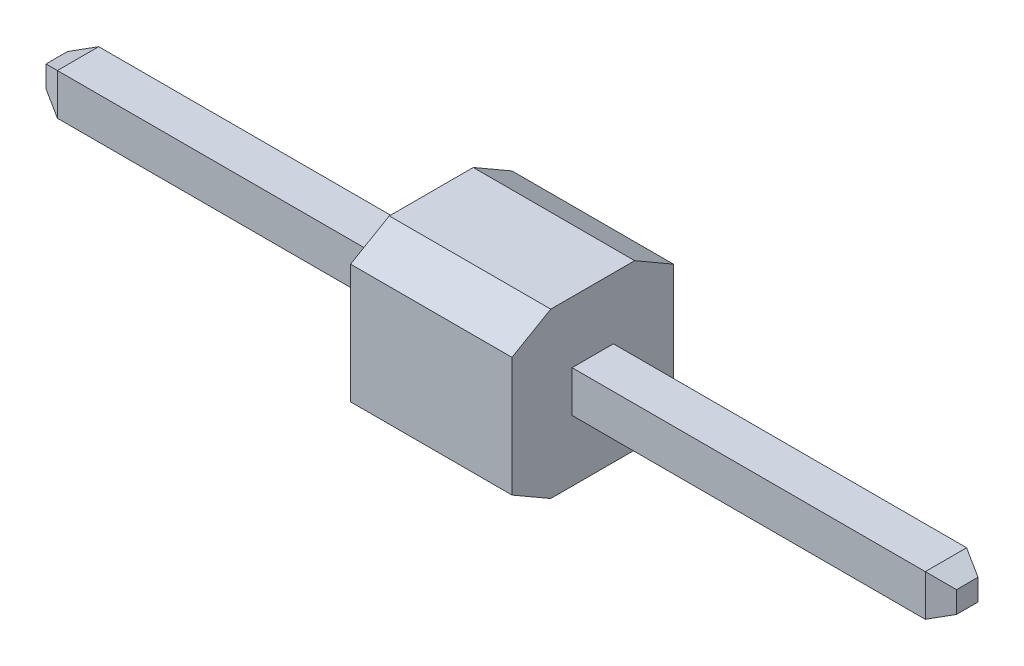
ISO-10303-21;
HEADER;
FILE_DESCRIPTION(('STEP AP214'),'2;1');
FILE_NAME('part.step','',(''),(''),'','','');
FILE_SCHEMA(('AUTOMOTIVE_DESIGN { 1 0 10303 214 1 1 1 1 }'));
ENDSEC;
DATA;
#1=APPLICATION_CONTEXT('core data for automotive mechanical design processes');
#2=APPLICATION_PROTOCOL_DEFINITION('international standard','automotive_design',2000,#1);
#3=PRODUCT_CONTEXT('',#1,'mechanical');
#4=PRODUCT('Part','Part','',(#3));
#5=PRODUCT_RELATED_PRODUCT_CATEGORY('part','',(#4));
#6=PRODUCT_DEFINITION_FORMATION('','',#4);
#7=PRODUCT_DEFINITION_CONTEXT('part definition',#1,'design');
#8=PRODUCT_DEFINITION('design','',#6,#7);
#9=PRODUCT_DEFINITION_SHAPE('','',#8);
#10=(LENGTH_UNIT() NAMED_UNIT(*) SI_UNIT(.MILLI.,.METRE.));
#11=(NAMED_UNIT(*) PLANE_ANGLE_UNIT() SI_UNIT($,.RADIAN.));
#12=(NAMED_UNIT(*) SI_UNIT($,.STERADIAN.) SOLID_ANGLE_UNIT());
#13=UNCERTAINTY_MEASURE_WITH_UNIT(LENGTH_MEASURE(1.E-05),#10,'distance_accuracy_value','');
#14=(GEOMETRIC_REPRESENTATION_CONTEXT(3) GLOBAL_UNCERTAINTY_ASSIGNED_CONTEXT((#13)) GLOBAL_UNIT_ASSIGNED_CONTEXT((#10,
#11,#12)) REPRESENTATION_CONTEXT('',''));
#15=CARTESIAN_POINT('',(0.,0.,0.));
#16=DIRECTION('',(0.,0.,1.));
#17=DIRECTION('',(1.,0.,0.));
#18=AXIS2_PLACEMENT_3D('',#15,#16,#17);
#19=CARTESIAN_POINT('',(5.42107489509749,-7.30288427394286,-2.77111992940321));
#20=DIRECTION('',(1.,-9.93476518829084E-08,4.37113882867379E-08));
#21=DIRECTION('',(-9.93476589883358E-08,-1.,8.74227765734759E-08));
#22=AXIS2_PLACEMENT_3D('',#19,#20,#21);
#23=PLANE('',#22);
#24=DIRECTION('',(-1.18186619959243E-08,-0.500000075710538,-0.866025360072935));
#25=VECTOR('',#24,1.);
#26=CARTESIAN_POINT('',(5.42107470292288,-8.54647397517509,-1.20111982068513));
#27=LINE('',#26,#25);
#28=CARTESIAN_POINT('',(5.42107470292288,-8.54647397517509,-1.20111982068513));
#29=VERTEX_POINT('',#28);
#30=CARTESIAN_POINT('',(5.42107469473467,-8.89288418914276,-1.80111979040099));
#31=VERTEX_POINT('',#30);
#32=EDGE_CURVE('E11',#29,#31,#27,.T.);
#33=ORIENTED_EDGE('',*,*,#32,.T.);
#34=DIRECTION('',(4.37113811813104E-08,-8.74227842254741E-08,-0.999999999999995));
#35=VECTOR('',#34,1.);
#36=CARTESIAN_POINT('',(5.42107469473467,-8.89288418914276,-1.80111979040099));
#37=LINE('',#36,#35);
#38=CARTESIAN_POINT('',(5.42107475155946,-8.89288430279238,-3.10111979040099));
#39=VERTEX_POINT('',#38);
#40=EDGE_CURVE('E304',#31,#39,#37,.T.);
#41=ORIENTED_EDGE('',*,*,#40,.T.);
#42=DIRECTION('',(8.75289950709516E-08,0.499999924289837,-0.866025447495713));
#43=VECTOR('',#42,1.);
#44=CARTESIAN_POINT('',(5.42107475155946,-8.89288430279238,-3.10111979040099));
#45=LINE('',#44,#43);
#46=CARTESIAN_POINT('',(5.42107481220133,-8.54647419373205,-3.70111982068513));
#47=VERTEX_POINT('',#46);
#48=EDGE_CURVE('E296',#39,#47,#45,.T.);
#49=ORIENTED_EDGE('',*,*,#48,.T.);
#50=DIRECTION('',(9.93476593243697E-08,0.999999999999991,-8.74227764821842E-08));
#51=VECTOR('',#50,1.);
#52=CARTESIAN_POINT('',(5.42107481220133,-8.54647419373205,-3.70111982068513));
#53=LINE('',#52,#51);
#54=CARTESIAN_POINT('',(5.42107499571431,-6.69929451676005,-3.70111998217071));
#55=VERTEX_POINT('',#54);
#56=EDGE_CURVE('E281',#47,#55,#53,.T.);
#57=ORIENTED_EDGE('',*,*,#56,.T.);
#58=DIRECTION('',(-1.18186632778994E-08,-0.500000075710539,-0.866025360072934));
#59=VECTOR('',#58,1.);
#60=CARTESIAN_POINT('',(5.42107500390252,-6.35288430279238,-3.10112001245485));
#61=LINE('',#60,#59);
#62=CARTESIAN_POINT('',(5.42107500390252,-6.35288430279238,-3.10112001245485));
#63=VERTEX_POINT('',#62);
#64=EDGE_CURVE('E265',#63,#55,#61,.T.);
#65=ORIENTED_EDGE('',*,*,#64,.F.);
#66=DIRECTION('',(4.37113811813104E-08,-8.74227835422599E-08,-0.999999999999995));
#67=VECTOR('',#66,1.);
#68=CARTESIAN_POINT('',(5.42107494707772,-6.35288418914276,-1.80112001245485));
#69=LINE('',#68,#67);
#70=CARTESIAN_POINT('',(5.42107494707772,-6.35288418914276,-1.80112001245485));
#71=VERTEX_POINT('',#70);
#72=EDGE_CURVE('E248',#71,#63,#69,.T.);
#73=ORIENTED_EDGE('',*,*,#72,.F.);
#74=DIRECTION('',(8.75289963529268E-08,0.499999924289837,-0.866025447495713));
#75=VECTOR('',#74,1.);
#76=CARTESIAN_POINT('',(5.42107488643585,-6.69929429820309,-1.20111998217071));
#77=LINE('',#76,#75);
#78=CARTESIAN_POINT('',(5.42107488643585,-6.69929429820309,-1.20111998217071));
#79=VERTEX_POINT('',#78);
#80=EDGE_CURVE('E242',#79,#71,#77,.T.);
#81=ORIENTED_EDGE('',*,*,#80,.F.);
#82=DIRECTION('',(9.93476593243697E-08,0.999999999999991,-8.74227763619768E-08));
#83=VECTOR('',#82,1.);
#84=CARTESIAN_POINT('',(5.42107470292288,-8.54647397517509,-1.20111982068513));
#85=LINE('',#84,#83);
#86=EDGE_CURVE('E236',#29,#79,#85,.T.);
#87=ORIENTED_EDGE('',*,*,#86,.F.);
#88=EDGE_LOOP('',(#33,#41,#49,#57,#65,#73,#81,#87));
#89=FACE_BOUND('',#88,.T.);
#90=DIRECTION('',(-4.37113817364219E-08,8.74227842895255E-08,0.999999999999995));
#91=VECTOR('',#90,1.);
#92=CARTESIAN_POINT('',(5.42107483151498,-7.94288427394286,-2.77111987345263));
#93=LINE('',#92,#91);
#94=CARTESIAN_POINT('',(5.42107483151498,-7.94288427394286,-2.77111987345263));
#95=VERTEX_POINT('',#94);
#96=CARTESIAN_POINT('',(5.4210748035397,-7.94288421799228,-2.13111987345263));
#97=VERTEX_POINT('',#96);
#98=EDGE_CURVE('E302',#95,#97,#93,.T.);
#99=ORIENTED_EDGE('',*,*,#98,.T.);
#100=DIRECTION('',(-9.93476592658907E-08,-0.999999999999991,8.74227759628525E-08));
#101=VECTOR('',#100,1.);
#102=CARTESIAN_POINT('',(5.4210748671222,-7.30288421799228,-2.13111992940321));
#103=LINE('',#102,#101);
#104=CARTESIAN_POINT('',(5.4210748671222,-7.30288421799228,-2.13111992940321));
#105=VERTEX_POINT('',#104);
#106=EDGE_CURVE('E293',#105,#97,#103,.T.);
#107=ORIENTED_EDGE('',*,*,#106,.F.);
#108=DIRECTION('',(-4.37113817364219E-08,8.74227842895254E-08,0.999999999999995));
#109=VECTOR('',#108,1.);
#110=CARTESIAN_POINT('',(5.42107489509749,-7.30288427394286,-2.77111992940321));
#111=LINE('',#110,#109);
#112=CARTESIAN_POINT('',(5.42107489509749,-7.30288427394286,-2.77111992940321));
#113=VERTEX_POINT('',#112);
#114=EDGE_CURVE('E278',#113,#105,#111,.T.);
#115=ORIENTED_EDGE('',*,*,#114,.F.);
#116=DIRECTION('',(-9.93476592658907E-08,-0.999999999999991,8.74227766567419E-08));
#117=VECTOR('',#116,1.);
#118=CARTESIAN_POINT('',(5.42107489509749,-7.30288427394286,-2.77111992940321));
#119=LINE('',#118,#117);
#120=EDGE_CURVE('E263',#113,#95,#119,.T.);
#121=ORIENTED_EDGE('',*,*,#120,.T.);
#122=EDGE_LOOP('',(#99,#107,#115,#121));
#123=FACE_BOUND('',#122,.T.);
#124=ADVANCED_FACE('F17',(#89,#123),#23,.T.);
#125=CARTESIAN_POINT('',(2.92107489509748,-7.30288402557373,-2.77112003868168));
#126=DIRECTION('',(1.,-9.93476518829084E-08,4.37113882867379E-08));
#127=DIRECTION('',(-9.93476589883358E-08,-1.,8.74227765734759E-08));
#128=AXIS2_PLACEMENT_3D('',#125,#126,#127);
#129=PLANE('',#128);
#130=DIRECTION('',(-1.18186626369119E-08,-0.500000075710538,-0.866025360072935));
#131=VECTOR('',#130,1.);
#132=CARTESIAN_POINT('',(2.92107470292288,-8.54647372680596,-1.2011199299636));
#133=LINE('',#132,#131);
#134=CARTESIAN_POINT('',(2.92107470292288,-8.54647372680596,-1.2011199299636));
#135=VERTEX_POINT('',#134);
#136=CARTESIAN_POINT('',(2.92107469473467,-8.89288394077363,-1.80111989967946));
#137=VERTEX_POINT('',#136);
#138=EDGE_CURVE('E24',#135,#137,#133,.T.);
#139=ORIENTED_EDGE('',*,*,#138,.F.);
#140=DIRECTION('',(9.9347659083955E-08,0.999999999999991,-8.74227763619768E-08));
#141=VECTOR('',#140,1.);
#142=CARTESIAN_POINT('',(2.92107470292288,-8.54647372680596,-1.2011199299636));
#143=LINE('',#142,#141);
#144=CARTESIAN_POINT('',(2.92107488643585,-6.69929404983396,-1.20112009144918));
#145=VERTEX_POINT('',#144);
#146=EDGE_CURVE('E300',#135,#145,#143,.T.);
#147=ORIENTED_EDGE('',*,*,#146,.T.);
#148=DIRECTION('',(8.75289963529268E-08,0.499999924289837,-0.866025447495713));
#149=VECTOR('',#148,1.);
#150=CARTESIAN_POINT('',(2.92107488643585,-6.69929404983396,-1.20112009144918));
#151=LINE('',#150,#149);
#152=CARTESIAN_POINT('',(2.92107494707772,-6.35288394077363,-1.80112012173332));
#153=VERTEX_POINT('',#152);
#154=EDGE_CURVE('E286',#145,#153,#151,.T.);
#155=ORIENTED_EDGE('',*,*,#154,.T.);
#156=DIRECTION('',(4.37113811813104E-08,-8.74227835422599E-08,-0.999999999999995));
#157=VECTOR('',#156,1.);
#158=CARTESIAN_POINT('',(2.92107494707772,-6.35288394077363,-1.80112012173332));
#159=LINE('',#158,#157);
#160=CARTESIAN_POINT('',(2.92107500390252,-6.35288405442325,-3.10112012173332));
#161=VERTEX_POINT('',#160);
#162=EDGE_CURVE('E271',#153,#161,#159,.T.);
#163=ORIENTED_EDGE('',*,*,#162,.T.);
#164=DIRECTION('',(-1.18186632778994E-08,-0.500000075710539,-0.866025360072934));
#165=VECTOR('',#164,1.);
#166=CARTESIAN_POINT('',(2.92107500390252,-6.35288405442325,-3.10112012173332));
#167=LINE('',#166,#165);
#168=CARTESIAN_POINT('',(2.92107499571431,-6.69929426839092,-3.70112009144918));
#169=VERTEX_POINT('',#168);
#170=EDGE_CURVE('E253',#161,#169,#167,.T.);
#171=ORIENTED_EDGE('',*,*,#170,.T.);
#172=DIRECTION('',(9.9347659083955E-08,0.999999999999991,-8.74227764821842E-08));
#173=VECTOR('',#172,1.);
#174=CARTESIAN_POINT('',(2.92107481220133,-8.54647394536292,-3.7011199299636));
#175=LINE('',#174,#173);
#176=CARTESIAN_POINT('',(2.92107481220133,-8.54647394536292,-3.7011199299636));
#177=VERTEX_POINT('',#176);
#178=EDGE_CURVE('E261',#177,#169,#175,.T.);
#179=ORIENTED_EDGE('',*,*,#178,.F.);
#180=DIRECTION('',(8.75289957119392E-08,0.499999924289837,-0.866025447495713));
#181=VECTOR('',#180,1.);
#182=CARTESIAN_POINT('',(2.92107475155946,-8.89288405442325,-3.10111989967946));
#183=LINE('',#182,#181);
#184=CARTESIAN_POINT('',(2.92107475155946,-8.89288405442325,-3.10111989967946));
#185=VERTEX_POINT('',#184);
#186=EDGE_CURVE('E276',#185,#177,#183,.T.);
#187=ORIENTED_EDGE('',*,*,#186,.F.);
#188=DIRECTION('',(4.37113811813104E-08,-8.74227842254741E-08,-0.999999999999995));
#189=VECTOR('',#188,1.);
#190=CARTESIAN_POINT('',(2.92107469473467,-8.89288394077363,-1.80111989967946));
#191=LINE('',#190,#189);
#192=EDGE_CURVE('E291',#137,#185,#191,.T.);
#193=ORIENTED_EDGE('',*,*,#192,.F.);
#194=EDGE_LOOP('',(#139,#147,#155,#163,#171,#179,#187,#193));
#195=FACE_BOUND('',#194,.T.);
#196=DIRECTION('',(-9.93476592658907E-08,-0.999999999999991,8.74227759628525E-08));
#197=VECTOR('',#196,1.);
#198=CARTESIAN_POINT('',(2.9210748671222,-7.30288396962315,-2.13112003868168));
#199=LINE('',#198,#197);
#200=CARTESIAN_POINT('',(2.9210748671222,-7.30288396962315,-2.13112003868168));
#201=VERTEX_POINT('',#200);
#202=CARTESIAN_POINT('',(2.9210748035397,-7.94288396962315,-2.1311199827311));
#203=VERTEX_POINT('',#202);
#204=EDGE_CURVE('E298',#201,#203,#199,.T.);
#205=ORIENTED_EDGE('',*,*,#204,.T.);
#206=DIRECTION('',(-4.37113817364219E-08,8.74227842895255E-08,0.999999999999995));
#207=VECTOR('',#206,1.);
#208=CARTESIAN_POINT('',(2.92107483151498,-7.94288402557373,-2.7711199827311));
#209=LINE('',#208,#207);
#210=CARTESIAN_POINT('',(2.92107483151498,-7.94288402557373,-2.7711199827311));
#211=VERTEX_POINT('',#210);
#212=EDGE_CURVE('E283',#211,#203,#209,.T.);
#213=ORIENTED_EDGE('',*,*,#212,.F.);
#214=DIRECTION('',(-9.93476585720013E-08,-0.999999999999991,8.74227766567419E-08));
#215=VECTOR('',#214,1.);
#216=CARTESIAN_POINT('',(2.92107489509748,-7.30288402557373,-2.77112003868168));
#217=LINE('',#216,#215);
#218=CARTESIAN_POINT('',(2.92107489509748,-7.30288402557373,-2.77112003868168));
#219=VERTEX_POINT('',#218);
#220=EDGE_CURVE('E268',#219,#211,#217,.T.);
#221=ORIENTED_EDGE('',*,*,#220,.F.);
#222=DIRECTION('',(-4.37113810425325E-08,8.74227842895254E-08,0.999999999999995));
#223=VECTOR('',#222,1.);
#224=CARTESIAN_POINT('',(2.92107489509748,-7.30288402557373,-2.77112003868168));
#225=LINE('',#224,#223);
#226=EDGE_CURVE('E251',#219,#201,#225,.T.);
#227=ORIENTED_EDGE('',*,*,#226,.T.);
#228=EDGE_LOOP('',(#205,#213,#221,#227));
#229=FACE_BOUND('',#228,.T.);
#230=ADVANCED_FACE('F314',(#195,#229),#129,.F.);
#231=CARTESIAN_POINT('',(5.42107470292288,-8.54647397517509,-1.20111982068513));
#232=DIRECTION('',(1.07893287081065E-07,0.866025360072937,-0.500000075710535));
#233=DIRECTION('',(1.18186629566715E-08,0.500000075710542,0.866025360072941));
#234=AXIS2_PLACEMENT_3D('',#231,#232,#233);
#235=PLANE('',#234);
#236=ORIENTED_EDGE('',*,*,#138,.T.);
#237=DIRECTION('',(-0.999999999999994,9.93476518829078E-08,-4.37113883755555E-08));
#238=VECTOR('',#237,1.);
#239=CARTESIAN_POINT('',(5.42107469473467,-8.89288418914276,-1.80111979040099));
#240=LINE('',#239,#238);
#241=EDGE_CURVE('E288',#31,#137,#240,.T.);
#242=ORIENTED_EDGE('',*,*,#241,.F.);
#243=ORIENTED_EDGE('',*,*,#32,.F.);
#244=DIRECTION('',(-0.999999999999994,9.93476518829078E-08,-4.3711388109102E-08));
#245=VECTOR('',#244,1.);
#246=CARTESIAN_POINT('',(5.42107470292288,-8.54647397517509,-1.20111982068513));
#247=LINE('',#246,#245);
#248=EDGE_CURVE('E256',#29,#135,#247,.T.);
#249=ORIENTED_EDGE('',*,*,#248,.T.);
#250=EDGE_LOOP('',(#236,#242,#243,#249));
#251=FACE_BOUND('',#250,.T.);
#252=ADVANCED_FACE('F306',(#251),#235,.F.);
#253=CARTESIAN_POINT('',(5.42107469473467,-8.89288418914276,-1.80111979040099));
#254=DIRECTION('',(9.93476589883358E-08,1.,-8.74227765734759E-08));
#255=DIRECTION('',(1.,-9.93476518829084E-08,4.37113882867379E-08));
#256=AXIS2_PLACEMENT_3D('',#253,#254,#255);
#257=PLANE('',#256);
#258=ORIENTED_EDGE('',*,*,#192,.T.);
#259=DIRECTION('',(-0.999999999999994,9.93476518829078E-08,-4.37113882867377E-08));
#260=VECTOR('',#259,1.);
#261=CARTESIAN_POINT('',(5.42107475155946,-8.89288430279238,-3.10111979040099));
#262=LINE('',#261,#260);
#263=EDGE_CURVE('E273',#39,#185,#262,.T.);
#264=ORIENTED_EDGE('',*,*,#263,.F.);
#265=ORIENTED_EDGE('',*,*,#40,.F.);
#266=ORIENTED_EDGE('',*,*,#241,.T.);
#267=EDGE_LOOP('',(#258,#264,#265,#266));
#268=FACE_BOUND('',#267,.T.);
#269=ADVANCED_FACE('F311',(#268),#257,.F.);
#270=CARTESIAN_POINT('',(5.42107475155946,-8.89288430279238,-3.10111979040099));
#271=DIRECTION('',(6.41819058997377E-08,0.866025447495721,0.499999924289845));
#272=DIRECTION('',(-8.7528996031702E-08,-0.499999924289838,0.866025447495717));
#273=AXIS2_PLACEMENT_3D('',#270,#271,#272);
#274=PLANE('',#273);
#275=ORIENTED_EDGE('',*,*,#186,.T.);
#276=DIRECTION('',(-0.999999999999994,9.93476518829078E-08,-4.37113882867377E-08));
#277=VECTOR('',#276,1.);
#278=CARTESIAN_POINT('',(5.42107481220133,-8.54647419373205,-3.70111982068513));
#279=LINE('',#278,#277);
#280=EDGE_CURVE('E258',#47,#177,#279,.T.);
#281=ORIENTED_EDGE('',*,*,#280,.F.);
#282=ORIENTED_EDGE('',*,*,#48,.F.);
#283=ORIENTED_EDGE('',*,*,#263,.T.);
#284=EDGE_LOOP('',(#275,#281,#282,#283));
#285=FACE_BOUND('',#284,.T.);
#286=ADVANCED_FACE('F319',(#285),#274,.F.);
#287=CARTESIAN_POINT('',(5.42107481220133,-8.54647419373205,-3.70111982068513));
#288=DIRECTION('',(-4.37113811813106E-08,8.74227836789032E-08,1.));
#289=DIRECTION('',(-1.,9.93476518829084E-08,-4.37113882867379E-08));
#290=AXIS2_PLACEMENT_3D('',#287,#288,#289);
#291=PLANE('',#290);
#292=ORIENTED_EDGE('',*,*,#178,.T.);
#293=DIRECTION('',(-0.999999999999994,9.93476518829078E-08,-4.37113882867377E-08));
#294=VECTOR('',#293,1.);
#295=CARTESIAN_POINT('',(5.42107499571431,-6.69929451676005,-3.70111998217071));
#296=LINE('',#295,#294);
#297=EDGE_CURVE('E245',#55,#169,#296,.T.);
#298=ORIENTED_EDGE('',*,*,#297,.F.);
#299=ORIENTED_EDGE('',*,*,#56,.F.);
#300=ORIENTED_EDGE('',*,*,#280,.T.);
#301=EDGE_LOOP('',(#292,#298,#299,#300));
#302=FACE_BOUND('',#301,.T.);
#303=ADVANCED_FACE('F326',(#302),#291,.F.);
#304=CARTESIAN_POINT('',(5.42107500390252,-6.35288430279238,-3.10112001245485));
#305=DIRECTION('',(1.07893287081065E-07,0.866025360072937,-0.500000075710535));
#306=DIRECTION('',(1.18186629566715E-08,0.500000075710542,0.866025360072941));
#307=AXIS2_PLACEMENT_3D('',#304,#305,#306);
#308=PLANE('',#307);
#309=ORIENTED_EDGE('',*,*,#170,.F.);
#310=DIRECTION('',(-0.999999999999994,9.93476522381792E-08,-4.37113882867377E-08));
#311=VECTOR('',#310,1.);
#312=CARTESIAN_POINT('',(5.42107500390252,-6.35288430279238,-3.10112001245485));
#313=LINE('',#312,#311);
#314=EDGE_CURVE('E239',#63,#161,#313,.T.);
#315=ORIENTED_EDGE('',*,*,#314,.F.);
#316=ORIENTED_EDGE('',*,*,#64,.T.);
#317=ORIENTED_EDGE('',*,*,#297,.T.);
#318=EDGE_LOOP('',(#309,#315,#316,#317));
#319=FACE_BOUND('',#318,.T.);
#320=ADVANCED_FACE('F329',(#319),#308,.T.);
#321=CARTESIAN_POINT('',(5.42107494707772,-6.35288418914276,-1.80112001245485));
#322=DIRECTION('',(9.93476589883358E-08,1.,-8.74227765734759E-08));
#323=DIRECTION('',(1.,-9.93476518829084E-08,4.37113882867379E-08));
#324=AXIS2_PLACEMENT_3D('',#321,#322,#323);
#325=PLANE('',#324);
#326=ORIENTED_EDGE('',*,*,#162,.F.);
#327=DIRECTION('',(-0.999999999999994,9.93476522381792E-08,-4.37113884643734E-08));
#328=VECTOR('',#327,1.);
#329=CARTESIAN_POINT('',(5.42107494707772,-6.35288418914276,-1.80112001245485));
#330=LINE('',#329,#328);
#331=EDGE_CURVE('E233',#71,#153,#330,.T.);
#332=ORIENTED_EDGE('',*,*,#331,.F.);
#333=ORIENTED_EDGE('',*,*,#72,.T.);
#334=ORIENTED_EDGE('',*,*,#314,.T.);
#335=EDGE_LOOP('',(#326,#332,#333,#334));
#336=FACE_BOUND('',#335,.T.);
#337=ADVANCED_FACE('F333',(#336),#325,.T.);
#338=CARTESIAN_POINT('',(5.42107488643585,-6.69929429820309,-1.20111998217071));
#339=DIRECTION('',(6.41819058997377E-08,0.866025447495721,0.499999924289845));
#340=DIRECTION('',(-8.7528996031702E-08,-0.499999924289838,0.866025447495717));
#341=AXIS2_PLACEMENT_3D('',#338,#339,#340);
#342=PLANE('',#341);
#343=ORIENTED_EDGE('',*,*,#154,.F.);
#344=DIRECTION('',(-0.999999999999994,9.93476518829078E-08,-4.3711388109102E-08));
#345=VECTOR('',#344,1.);
#346=CARTESIAN_POINT('',(5.42107488643585,-6.69929429820309,-1.20111998217071));
#347=LINE('',#346,#345);
#348=EDGE_CURVE('E230',#79,#145,#347,.T.);
#349=ORIENTED_EDGE('',*,*,#348,.F.);
#350=ORIENTED_EDGE('',*,*,#80,.T.);
#351=ORIENTED_EDGE('',*,*,#331,.T.);
#352=EDGE_LOOP('',(#343,#349,#350,#351));
#353=FACE_BOUND('',#352,.T.);
#354=ADVANCED_FACE('F337',(#353),#342,.T.);
#355=CARTESIAN_POINT('',(5.42107470292288,-8.54647397517509,-1.20111982068513));
#356=DIRECTION('',(-4.37113811813106E-08,8.74227835615132E-08,1.));
#357=DIRECTION('',(-9.93476589883358E-08,-1.,8.74227764560859E-08));
#358=AXIS2_PLACEMENT_3D('',#355,#356,#357);
#359=PLANE('',#358);
#360=ORIENTED_EDGE('',*,*,#146,.F.);
#361=ORIENTED_EDGE('',*,*,#248,.F.);
#362=ORIENTED_EDGE('',*,*,#86,.T.);
#363=ORIENTED_EDGE('',*,*,#348,.T.);
#364=EDGE_LOOP('',(#360,#361,#362,#363));
#365=FACE_BOUND('',#364,.T.);
#366=ADVANCED_FACE('F339',(#365),#359,.T.);
#367=CARTESIAN_POINT('',(-2.87892510490252,-7.30288344935735,-2.77112029220773));
#368=DIRECTION('',(-1.,9.93476518829084E-08,-4.37113882867379E-08));
#369=DIRECTION('',(9.93476589883358E-08,1.,-8.74227765734759E-08));
#370=AXIS2_PLACEMENT_3D('',#367,#368,#369);
#371=PLANE('',#370);
#372=DIRECTION('',(9.93476581453995E-08,0.999999999999991,-8.74227774760709E-08));
#373=VECTOR('',#372,1.);
#374=CARTESIAN_POINT('',(-2.87892517444616,-7.78900187966852,-2.2850017769009));
#375=LINE('',#374,#373);
#376=CARTESIAN_POINT('',(-2.87892517444616,-7.78900187966852,-2.2850017769009));
#377=VERTEX_POINT('',#376);
#378=CARTESIAN_POINT('',(-2.87892514143919,-7.45676493405052,-2.28500180594598));
#379=VERTEX_POINT('',#378);
#380=EDGE_CURVE('E228',#377,#379,#375,.T.);
#381=ORIENTED_EDGE('',*,*,#380,.T.);
#382=DIRECTION('',(4.37113793813867E-08,-8.74227801493995E-08,-0.999999999999995));
#383=VECTOR('',#382,1.);
#384=CARTESIAN_POINT('',(-2.8789251414392,-7.45676493405052,-2.28500180594598));
#385=LINE('',#384,#383);
#386=CARTESIAN_POINT('',(-2.87892512691666,-7.4567649630956,-2.61723875156398));
#387=VERTEX_POINT('',#386);
#388=EDGE_CURVE('E223',#379,#387,#385,.T.);
#389=ORIENTED_EDGE('',*,*,#388,.T.);
#390=DIRECTION('',(-9.93476608187277E-08,-0.999999999999991,8.74227761394067E-08));
#391=VECTOR('',#390,1.);
#392=CARTESIAN_POINT('',(-2.87892512691666,-7.4567649630956,-2.61723875156398));
#393=LINE('',#392,#391);
#394=CARTESIAN_POINT('',(-2.87892515992362,-7.7890019087136,-2.6172387225189));
#395=VERTEX_POINT('',#394);
#396=EDGE_CURVE('E215',#387,#395,#393,.T.);
#397=ORIENTED_EDGE('',*,*,#396,.T.);
#398=DIRECTION('',(-4.37113767080584E-08,8.74227828227278E-08,0.999999999999995));
#399=VECTOR('',#398,1.);
#400=CARTESIAN_POINT('',(-2.87892515992362,-7.7890019087136,-2.6172387225189));
#401=LINE('',#400,#399);
#402=EDGE_CURVE('E207',#395,#377,#401,.T.);
#403=ORIENTED_EDGE('',*,*,#402,.T.);
#404=EDGE_LOOP('',(#381,#389,#397,#403));
#405=FACE_BOUND('',#404,.T.);
#406=ADVANCED_FACE('F341',(#405),#371,.T.);
#407=CARTESIAN_POINT('',(-2.87892510490252,-7.30288344935735,-2.77112029220773));
#408=DIRECTION('',(9.93476589883358E-08,1.,-8.74227764510112E-08));
#409=DIRECTION('',(-4.37113811813106E-08,8.74227835564385E-08,1.));
#410=AXIS2_PLACEMENT_3D('',#407,#408,#409);
#411=PLANE('',#410);
#412=DIRECTION('',(0.999999999999994,-9.93476522661073E-08,4.37113882769953E-08));
#413=VECTOR('',#412,1.);
#414=CARTESIAN_POINT('',(-2.54892510490251,-7.30288348214207,-2.77112027778297));
#415=LINE('',#414,#413);
#416=CARTESIAN_POINT('',(-2.54892510490251,-7.30288348214207,-2.77112027778297));
#417=VERTEX_POINT('',#416);
#418=EDGE_CURVE('E225',#417,#219,#415,.T.);
#419=ORIENTED_EDGE('',*,*,#418,.F.);
#420=DIRECTION('',(-4.37113817364219E-08,8.74227842895255E-08,0.999999999999995));
#421=VECTOR('',#420,1.);
#422=CARTESIAN_POINT('',(-2.54892510490251,-7.30288348214207,-2.77112027778297));
#423=LINE('',#422,#421);
#424=CARTESIAN_POINT('',(-2.5489251328778,-7.30288342619149,-2.13112027778297));
#425=VERTEX_POINT('',#424);
#426=EDGE_CURVE('E217',#417,#425,#423,.T.);
#427=ORIENTED_EDGE('',*,*,#426,.T.);
#428=DIRECTION('',(0.999999999999994,-9.93476522661073E-08,4.37113882769953E-08));
#429=VECTOR('',#428,1.);
#430=CARTESIAN_POINT('',(-2.5489251328778,-7.30288342619149,-2.13112027778297));
#431=LINE('',#430,#429);
#432=EDGE_CURVE('E220',#425,#201,#431,.T.);
#433=ORIENTED_EDGE('',*,*,#432,.T.);
#434=ORIENTED_EDGE('',*,*,#226,.F.);
#435=EDGE_LOOP('',(#419,#427,#433,#434));
#436=FACE_BOUND('',#435,.T.);
#437=ADVANCED_FACE('F348',(#436),#411,.T.);
#438=CARTESIAN_POINT('',(-2.8789251328778,-7.30288339340677,-2.13112029220773));
#439=DIRECTION('',(-4.37113811813106E-08,8.74227836789032E-08,1.));
#440=DIRECTION('',(-1.,9.93476518829084E-08,-4.37113882867379E-08));
#441=AXIS2_PLACEMENT_3D('',#438,#439,#440);
#442=PLANE('',#441);
#443=ORIENTED_EDGE('',*,*,#432,.F.);
#444=DIRECTION('',(-9.93476592658907E-08,-0.999999999999991,8.74227766567419E-08));
#445=VECTOR('',#444,1.);
#446=CARTESIAN_POINT('',(-2.5489251328778,-7.30288342619149,-2.13112027778297));
#447=LINE('',#446,#445);
#448=CARTESIAN_POINT('',(-2.5489251964603,-7.94288342619149,-2.1311202218324));
#449=VERTEX_POINT('',#448);
#450=EDGE_CURVE('E209',#425,#449,#447,.T.);
#451=ORIENTED_EDGE('',*,*,#450,.T.);
#452=DIRECTION('',(0.999999999999994,-9.93476517789893E-08,4.37113882769953E-08));
#453=VECTOR('',#452,1.);
#454=CARTESIAN_POINT('',(-2.5489251964603,-7.94288342619149,-2.1311202218324));
#455=LINE('',#454,#453);
#456=EDGE_CURVE('E212',#449,#203,#455,.T.);
#457=ORIENTED_EDGE('',*,*,#456,.T.);
#458=ORIENTED_EDGE('',*,*,#204,.F.);
#459=EDGE_LOOP('',(#443,#451,#457,#458));
#460=FACE_BOUND('',#459,.T.);
#461=ADVANCED_FACE('F424',(#460),#442,.T.);
#462=CARTESIAN_POINT('',(-2.87892516848502,-7.94288344935735,-2.77112023625715));
#463=DIRECTION('',(9.93476589883357E-08,1.,-8.74227764040693E-08));
#464=DIRECTION('',(-4.37113811813106E-08,8.74227835094966E-08,1.));
#465=AXIS2_PLACEMENT_3D('',#462,#463,#464);
#466=PLANE('',#465);
#467=ORIENTED_EDGE('',*,*,#456,.F.);
#468=DIRECTION('',(4.37113831242006E-08,-8.74227856773042E-08,-0.999999999999995));
#469=VECTOR('',#468,1.);
#470=CARTESIAN_POINT('',(-2.5489251964603,-7.94288342619149,-2.1311202218324));
#471=LINE('',#470,#469);
#472=CARTESIAN_POINT('',(-2.54892516848502,-7.94288348214207,-2.7711202218324));
#473=VERTEX_POINT('',#472);
#474=EDGE_CURVE('E201',#449,#473,#471,.T.);
#475=ORIENTED_EDGE('',*,*,#474,.T.);
#476=DIRECTION('',(0.999999999999994,-9.93476517789893E-08,4.37113883581816E-08));
#477=VECTOR('',#476,1.);
#478=CARTESIAN_POINT('',(-2.54892516848502,-7.94288348214207,-2.7711202218324));
#479=LINE('',#478,#477);
#480=EDGE_CURVE('E204',#473,#211,#479,.T.);
#481=ORIENTED_EDGE('',*,*,#480,.T.);
#482=ORIENTED_EDGE('',*,*,#212,.T.);
#483=EDGE_LOOP('',(#467,#475,#481,#482));
#484=FACE_BOUND('',#483,.T.);
#485=ADVANCED_FACE('F421',(#484),#466,.F.);
#486=CARTESIAN_POINT('',(-2.87892510490252,-7.30288344935735,-2.77112029220773));
#487=DIRECTION('',(-4.37113811813106E-08,8.74227836789032E-08,1.));
#488=DIRECTION('',(-1.,9.93476518829084E-08,-4.37113882867379E-08));
#489=AXIS2_PLACEMENT_3D('',#486,#487,#488);
#490=PLANE('',#489);
#491=ORIENTED_EDGE('',*,*,#480,.F.);
#492=DIRECTION('',(9.93476578781121E-08,0.999999999999991,-8.74227759628526E-08));
#493=VECTOR('',#492,1.);
#494=CARTESIAN_POINT('',(-2.54892516848502,-7.94288348214207,-2.7711202218324));
#495=LINE('',#494,#493);
#496=EDGE_CURVE('E196',#473,#417,#495,.T.);
#497=ORIENTED_EDGE('',*,*,#496,.T.);
#498=ORIENTED_EDGE('',*,*,#418,.T.);
#499=ORIENTED_EDGE('',*,*,#220,.T.);
#500=EDGE_LOOP('',(#491,#497,#498,#499));
#501=FACE_BOUND('',#500,.T.);
#502=ADVANCED_FACE('F376',(#501),#490,.F.);
#503=CARTESIAN_POINT('',(-2.87892510490252,-7.30288344935735,-2.77112029220773));
#504=DIRECTION('',(-4.37113811813106E-08,8.74227836789032E-08,1.));
#505=DIRECTION('',(-1.,9.93476518829084E-08,-4.37113882867379E-08));
#506=AXIS2_PLACEMENT_3D('',#503,#504,#505);
#507=PLANE('',#506);
#508=DIRECTION('',(0.999999999999994,-9.9347651941362E-08,4.37113882769953E-08));
#509=VECTOR('',#508,1.);
#510=CARTESIAN_POINT('',(5.42107489509749,-7.30288427394286,-2.77111992940321));
#511=LINE('',#510,#509);
#512=CARTESIAN_POINT('',(10.8910748950975,-7.30288481737452,-2.77111969030191));
#513=VERTEX_POINT('',#512);
#514=EDGE_CURVE('E199',#113,#513,#511,.T.);
#515=ORIENTED_EDGE('',*,*,#514,.T.);
#516=DIRECTION('',(-9.9347663429227E-08,-0.999999999999991,8.74227766567419E-08));
#517=VECTOR('',#516,1.);
#518=CARTESIAN_POINT('',(10.8910748950975,-7.30288481737452,-2.77111969030191));
#519=LINE('',#518,#517);
#520=CARTESIAN_POINT('',(10.891074831515,-7.94288481737452,-2.77111963435134));
#521=VERTEX_POINT('',#520);
#522=EDGE_CURVE('E191',#513,#521,#519,.T.);
#523=ORIENTED_EDGE('',*,*,#522,.T.);
#524=DIRECTION('',(0.999999999999994,-9.9347651941362E-08,4.37113882769953E-08));
#525=VECTOR('',#524,1.);
#526=CARTESIAN_POINT('',(5.42107483151498,-7.94288427394286,-2.77111987345263));
#527=LINE('',#526,#525);
#528=EDGE_CURVE('E194',#95,#521,#527,.T.);
#529=ORIENTED_EDGE('',*,*,#528,.F.);
#530=ORIENTED_EDGE('',*,*,#120,.F.);
#531=EDGE_LOOP('',(#515,#523,#529,#530));
#532=FACE_BOUND('',#531,.T.);
#533=ADVANCED_FACE('F367',(#532),#507,.F.);
#534=CARTESIAN_POINT('',(-2.87892516848502,-7.94288344935735,-2.77112023625715));
#535=DIRECTION('',(9.93476589883357E-08,1.,-8.74227764040693E-08));
#536=DIRECTION('',(-4.37113811813106E-08,8.74227835094966E-08,1.));
#537=AXIS2_PLACEMENT_3D('',#534,#535,#536);
#538=PLANE('',#537);
#539=ORIENTED_EDGE('',*,*,#528,.T.);
#540=DIRECTION('',(-4.37113817364219E-08,8.74227842895255E-08,0.999999999999995));
#541=VECTOR('',#540,1.);
#542=CARTESIAN_POINT('',(10.891074831515,-7.94288481737452,-2.77111963435134));
#543=LINE('',#542,#541);
#544=CARTESIAN_POINT('',(10.8910748035397,-7.94288476142393,-2.13111963435134));
#545=VERTEX_POINT('',#544);
#546=EDGE_CURVE('E186',#521,#545,#543,.T.);
#547=ORIENTED_EDGE('',*,*,#546,.T.);
#548=DIRECTION('',(0.999999999999994,-9.9347651941362E-08,4.37113880334363E-08));
#549=VECTOR('',#548,1.);
#550=CARTESIAN_POINT('',(5.4210748035397,-7.94288421799228,-2.13111987345263));
#551=LINE('',#550,#549);
#552=EDGE_CURVE('E189',#97,#545,#551,.T.);
#553=ORIENTED_EDGE('',*,*,#552,.F.);
#554=ORIENTED_EDGE('',*,*,#98,.F.);
#555=EDGE_LOOP('',(#539,#547,#553,#554));
#556=FACE_BOUND('',#555,.T.);
#557=ADVANCED_FACE('F364',(#556),#538,.F.);
#558=CARTESIAN_POINT('',(-2.8789251328778,-7.30288339340677,-2.13112029220773));
#559=DIRECTION('',(-4.37113811813106E-08,8.74227836789032E-08,1.));
#560=DIRECTION('',(-1.,9.93476518829084E-08,-4.37113882867379E-08));
#561=AXIS2_PLACEMENT_3D('',#558,#559,#560);
#562=PLANE('',#561);
#563=ORIENTED_EDGE('',*,*,#552,.T.);
#564=DIRECTION('',(9.93476578781121E-08,0.999999999999991,-8.74227773506314E-08));
#565=VECTOR('',#564,1.);
#566=CARTESIAN_POINT('',(10.8910748035397,-7.94288476142393,-2.13111963435134));
#567=LINE('',#566,#565);
#568=CARTESIAN_POINT('',(10.8910748671222,-7.30288476142393,-2.13111969030192));
#569=VERTEX_POINT('',#568);
#570=EDGE_CURVE('E176',#545,#569,#567,.T.);
#571=ORIENTED_EDGE('',*,*,#570,.T.);
#572=DIRECTION('',(0.999999999999994,-9.9347651941362E-08,4.37113881146227E-08));
#573=VECTOR('',#572,1.);
#574=CARTESIAN_POINT('',(5.4210748671222,-7.30288421799228,-2.13111992940321));
#575=LINE('',#574,#573);
#576=EDGE_CURVE('E179',#105,#569,#575,.T.);
#577=ORIENTED_EDGE('',*,*,#576,.F.);
#578=ORIENTED_EDGE('',*,*,#106,.T.);
#579=EDGE_LOOP('',(#563,#571,#577,#578));
#580=FACE_BOUND('',#579,.T.);
#581=ADVANCED_FACE('F366',(#580),#562,.T.);
#582=CARTESIAN_POINT('',(-2.87892510490252,-7.30288344935735,-2.77112029220773));
#583=DIRECTION('',(9.93476589883358E-08,1.,-8.74227764510112E-08));
#584=DIRECTION('',(-4.37113811813106E-08,8.74227835564385E-08,1.));
#585=AXIS2_PLACEMENT_3D('',#582,#583,#584);
#586=PLANE('',#585);
#587=ORIENTED_EDGE('',*,*,#576,.T.);
#588=DIRECTION('',(4.37113817364219E-08,-8.74227842895255E-08,-0.999999999999995));
#589=VECTOR('',#588,1.);
#590=CARTESIAN_POINT('',(10.8910748671222,-7.30288476142393,-2.13111969030192));
#591=LINE('',#590,#589);
#592=EDGE_CURVE('E167',#569,#513,#591,.T.);
#593=ORIENTED_EDGE('',*,*,#592,.T.);
#594=ORIENTED_EDGE('',*,*,#514,.F.);
#595=ORIENTED_EDGE('',*,*,#114,.T.);
#596=EDGE_LOOP('',(#587,#593,#594,#595));
#597=FACE_BOUND('',#596,.T.);
#598=ADVANCED_FACE('F373',(#597),#586,.T.);
#599=CARTESIAN_POINT('',(11.2210748950975,-7.30288485015924,-2.77111967587716));
#600=DIRECTION('',(-1.,9.93476518829084E-08,-4.37113882867379E-08));
#601=DIRECTION('',(9.93476589883358E-08,1.,-8.74227765734759E-08));
#602=AXIS2_PLACEMENT_3D('',#599,#600,#601);
#603=PLANE('',#602);
#604=DIRECTION('',(-9.93476581453995E-08,-0.999999999999991,8.74227761394067E-08));
#605=VECTOR('',#604,1.);
#606=CARTESIAN_POINT('',(11.2210748585608,-7.45676633485241,-2.28500118961541));
#607=LINE('',#606,#605);
#608=CARTESIAN_POINT('',(11.2210748585608,-7.45676633485241,-2.28500118961541));
#609=VERTEX_POINT('',#608);
#610=CARTESIAN_POINT('',(11.2210748255538,-7.78900328047041,-2.28500116057033));
#611=VERTEX_POINT('',#610);
#612=EDGE_CURVE('E153',#609,#611,#607,.T.);
#613=ORIENTED_EDGE('',*,*,#612,.T.);
#614=DIRECTION('',(4.37113820547149E-08,-8.74227854960561E-08,-0.999999999999995));
#615=VECTOR('',#614,1.);
#616=CARTESIAN_POINT('',(11.2210748255538,-7.78900328047041,-2.28500116057033));
#617=LINE('',#616,#615);
#618=CARTESIAN_POINT('',(11.2210748400764,-7.78900330951549,-2.61723810618833));
#619=VERTEX_POINT('',#618);
#620=EDGE_CURVE('E395',#611,#619,#617,.T.);
#621=ORIENTED_EDGE('',*,*,#620,.T.);
#622=DIRECTION('',(9.93476581453995E-08,0.999999999999991,-8.74227761394067E-08));
#623=VECTOR('',#622,1.);
#624=CARTESIAN_POINT('',(11.2210748400764,-7.78900330951549,-2.61723810618833));
#625=LINE('',#624,#623);
#626=CARTESIAN_POINT('',(11.2210748730833,-7.45676636389749,-2.61723813523341));
#627=VERTEX_POINT('',#626);
#628=EDGE_CURVE('E156',#619,#627,#625,.T.);
#629=ORIENTED_EDGE('',*,*,#628,.T.);
#630=DIRECTION('',(-4.37113874013715E-08,8.74227801493996E-08,0.999999999999995));
#631=VECTOR('',#630,1.);
#632=CARTESIAN_POINT('',(11.2210748730833,-7.45676636389749,-2.61723813523341));
#633=LINE('',#632,#631);
#634=EDGE_CURVE('E149',#627,#609,#633,.T.);
#635=ORIENTED_EDGE('',*,*,#634,.T.);
#636=EDGE_LOOP('',(#613,#621,#629,#635));
#637=FACE_BOUND('',#636,.T.);
#638=ADVANCED_FACE('F151',(#637),#603,.F.);
#639=CARTESIAN_POINT('',(-2.87892515319725,-7.78900192216635,-2.77112024970991));
#640=DIRECTION('',(-0.422618351780369,-0.906307745050466,6.07587120833484E-08));
#641=DIRECTION('',(4.37113811813106E-08,-8.74227835094966E-08,-1.));
#642=AXIS2_PLACEMENT_3D('',#639,#640,#641);
#643=PLANE('',#642);
#644=DIRECTION('',(0.83481707378875,-0.389281669540041,0.389281691158097));
#645=VECTOR('',#644,1.);
#646=CARTESIAN_POINT('',(-2.87892517444585,-7.78900187966819,-2.28500177690124));
#647=LINE('',#646,#645);
#648=EDGE_CURVE('E181',#377,#449,#647,.T.);
#649=ORIENTED_EDGE('',*,*,#648,.F.);
#650=ORIENTED_EDGE('',*,*,#402,.F.);
#651=DIRECTION('',(-0.834817107820822,0.389281737604206,0.389281550111905));
#652=VECTOR('',#651,1.);
#653=CARTESIAN_POINT('',(-2.5489251684848,-7.94288348214184,-2.77112022183216));
#654=LINE('',#653,#652);
#655=EDGE_CURVE('E404',#473,#395,#654,.T.);
#656=ORIENTED_EDGE('',*,*,#655,.F.);
#657=ORIENTED_EDGE('',*,*,#474,.F.);
#658=EDGE_LOOP('',(#649,#650,#656,#657));
#659=FACE_BOUND('',#658,.T.);
#660=ADVANCED_FACE('F418',(#659),#643,.T.);
#661=CARTESIAN_POINT('',(-2.87892511162889,-7.3028834359046,-2.61723876501673));
#662=DIRECTION('',(-0.422618222124847,-3.72458176658199E-08,-0.906307805509828));
#663=DIRECTION('',(9.93476589883358E-08,1.,-8.74227765734759E-08));
#664=AXIS2_PLACEMENT_3D('',#661,#662,#663);
#665=PLANE('',#664);
#666=ORIENTED_EDGE('',*,*,#655,.T.);
#667=ORIENTED_EDGE('',*,*,#396,.F.);
#668=DIRECTION('',(-0.834817185169258,-0.389281503665794,0.389281618176064));
#669=VECTOR('',#668,1.);
#670=CARTESIAN_POINT('',(-2.54892510490234,-7.30288348214226,-2.77112027778279));
#671=LINE('',#670,#669);
#672=EDGE_CURVE('E160',#417,#387,#671,.T.);
#673=ORIENTED_EDGE('',*,*,#672,.F.);
#674=ORIENTED_EDGE('',*,*,#496,.F.);
#675=EDGE_LOOP('',(#666,#667,#673,#674));
#676=FACE_BOUND('',#675,.T.);
#677=ADVANCED_FACE('F434',(#676),#665,.T.);
#678=CARTESIAN_POINT('',(-2.5489251328778,-7.30288342619149,-2.13112027778297));
#679=DIRECTION('',(0.422618301356777,-1.21218081559392E-07,-0.906307768563367));
#680=DIRECTION('',(-9.93476589883358E-08,-1.,8.74227765734759E-08));
#681=AXIS2_PLACEMENT_3D('',#678,#679,#680);
#682=PLANE('',#681);
#683=ORIENTED_EDGE('',*,*,#648,.T.);
#684=ORIENTED_EDGE('',*,*,#450,.F.);
#685=DIRECTION('',(0.834817151137183,0.38928157172996,0.389281623093937));
#686=VECTOR('',#685,1.);
#687=CARTESIAN_POINT('',(-2.87892514143911,-7.45676493405061,-2.28500180594608));
#688=LINE('',#687,#686);
#689=EDGE_CURVE('E170',#379,#425,#688,.T.);
#690=ORIENTED_EDGE('',*,*,#689,.F.);
#691=ORIENTED_EDGE('',*,*,#380,.F.);
#692=EDGE_LOOP('',(#683,#684,#690,#691));
#693=FACE_BOUND('',#692,.T.);
#694=ADVANCED_FACE('F413',(#693),#682,.F.);
#695=CARTESIAN_POINT('',(-2.54892510490251,-7.30288348214207,-2.77112027778297));
#696=DIRECTION('',(0.422618171701255,-0.906307829022729,9.770517399793E-08));
#697=DIRECTION('',(-4.37113811813106E-08,8.74227835564385E-08,1.));
#698=AXIS2_PLACEMENT_3D('',#695,#696,#697);
#699=PLANE('',#698);
#700=ORIENTED_EDGE('',*,*,#672,.T.);
#701=ORIENTED_EDGE('',*,*,#388,.F.);
#702=ORIENTED_EDGE('',*,*,#689,.T.);
#703=ORIENTED_EDGE('',*,*,#426,.F.);
#704=EDGE_LOOP('',(#700,#701,#702,#703));
#705=FACE_BOUND('',#704,.T.);
#706=ADVANCED_FACE('F429',(#705),#699,.F.);
#707=CARTESIAN_POINT('',(11.2210748798097,-7.45676637735024,-2.77111966242441));
#708=DIRECTION('',(0.422618351780369,0.906307745050466,-6.07587121258922E-08));
#709=DIRECTION('',(4.37113811813106E-08,-8.74227835564385E-08,-1.));
#710=AXIS2_PLACEMENT_3D('',#707,#708,#709);
#711=PLANE('',#710);
#712=DIRECTION('',(-0.834817107820823,0.389281737604205,0.389281550111904));
#713=VECTOR('',#712,1.);
#714=CARTESIAN_POINT('',(11.2210748585605,-7.45676633485274,-2.28500118961574));
#715=LINE('',#714,#713);
#716=EDGE_CURVE('E164',#609,#569,#715,.T.);
#717=ORIENTED_EDGE('',*,*,#716,.F.);
#718=ORIENTED_EDGE('',*,*,#634,.F.);
#719=DIRECTION('',(0.834817073788749,-0.38928166954004,0.389281691158098));
#720=VECTOR('',#719,1.);
#721=CARTESIAN_POINT('',(10.8910748950975,-7.30288481737452,-2.77111969030191));
#722=LINE('',#721,#720);
#723=EDGE_CURVE('E392',#513,#627,#722,.T.);
#724=ORIENTED_EDGE('',*,*,#723,.F.);
#725=ORIENTED_EDGE('',*,*,#592,.F.);
#726=EDGE_LOOP('',(#717,#718,#724,#725));
#727=FACE_BOUND('',#726,.T.);
#728=ADVANCED_FACE('F165',(#727),#711,.T.);
#729=CARTESIAN_POINT('',(10.8910748950975,-7.30288481737452,-2.77111969030191));
#730=DIRECTION('',(-0.422618301356777,1.21218081559392E-07,0.906307768563367));
#731=DIRECTION('',(-9.93476589883358E-08,-1.,8.74227765734759E-08));
#732=AXIS2_PLACEMENT_3D('',#729,#730,#731);
#733=PLANE('',#732);
#734=ORIENTED_EDGE('',*,*,#723,.T.);
#735=ORIENTED_EDGE('',*,*,#628,.F.);
#736=DIRECTION('',(0.834817151137182,0.389281571729962,0.389281623093935));
#737=VECTOR('',#736,1.);
#738=CARTESIAN_POINT('',(10.8910748315149,-7.94288481737448,-2.77111963435119));
#739=LINE('',#738,#737);
#740=EDGE_CURVE('E389',#521,#619,#739,.T.);
#741=ORIENTED_EDGE('',*,*,#740,.F.);
#742=ORIENTED_EDGE('',*,*,#522,.F.);
#743=EDGE_LOOP('',(#734,#735,#741,#742));
#744=FACE_BOUND('',#743,.T.);
#745=ADVANCED_FACE('F390',(#744),#733,.F.);
#746=CARTESIAN_POINT('',(11.2210748738486,-7.30288480766141,-2.28500120306816));
#747=DIRECTION('',(0.422618222124847,3.72458176658199E-08,0.906307805509828));
#748=DIRECTION('',(9.93476589883358E-08,1.,-8.74227765734759E-08));
#749=AXIS2_PLACEMENT_3D('',#746,#747,#748);
#750=PLANE('',#749);
#751=ORIENTED_EDGE('',*,*,#716,.T.);
#752=ORIENTED_EDGE('',*,*,#570,.F.);
#753=DIRECTION('',(-0.834817185169258,-0.389281503665795,0.389281618176063));
#754=VECTOR('',#753,1.);
#755=CARTESIAN_POINT('',(11.2210748255535,-7.78900328047008,-2.28500116057066));
#756=LINE('',#755,#754);
#757=EDGE_CURVE('E175',#611,#545,#756,.T.);
#758=ORIENTED_EDGE('',*,*,#757,.F.);
#759=ORIENTED_EDGE('',*,*,#612,.F.);
#760=EDGE_LOOP('',(#751,#752,#758,#759));
#761=FACE_BOUND('',#760,.T.);
#762=ADVANCED_FACE('F173',(#761),#750,.T.);
#763=CARTESIAN_POINT('',(10.891074831515,-7.94288481737452,-2.77111963435134));
#764=DIRECTION('',(-0.422618171701255,0.906307829022729,-9.77051739553862E-08));
#765=DIRECTION('',(-4.37113811813106E-08,8.74227835094966E-08,1.));
#766=AXIS2_PLACEMENT_3D('',#763,#764,#765);
#767=PLANE('',#766);
#768=ORIENTED_EDGE('',*,*,#740,.T.);
#769=ORIENTED_EDGE('',*,*,#620,.F.);
#770=ORIENTED_EDGE('',*,*,#757,.T.);
#771=ORIENTED_EDGE('',*,*,#546,.F.);
#772=EDGE_LOOP('',(#768,#769,#770,#771));
#773=FACE_BOUND('',#772,.T.);
#774=ADVANCED_FACE('F394',(#773),#767,.F.);
#775=CLOSED_SHELL('',(#124,#230,#252,#269,#286,#303,#320,#337,#354,#366,#406,#437,#461,#485,
#502,#533,#557,#581,#598,#638,#660,#677,#694,#706,#728,#745,#762,#774));
#776=MANIFOLD_SOLID_BREP('B1',#775);
#777=ADVANCED_BREP_SHAPE_REPRESENTATION('',(#18,#776),#14);
#778=SHAPE_DEFINITION_REPRESENTATION(#9,#777);
ENDSEC;
END-ISO-10303-21;
